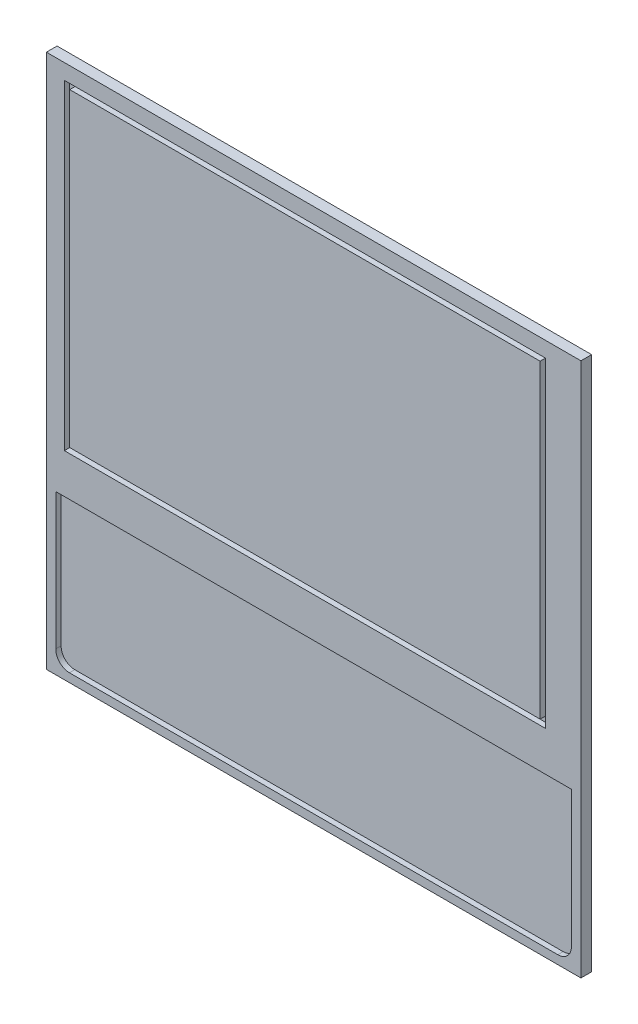
ISO-10303-21;
HEADER;
FILE_DESCRIPTION(('STEP AP214'),'2;1');
FILE_NAME('part.step','',(''),(''),'','','');
FILE_SCHEMA(('AUTOMOTIVE_DESIGN { 1 0 10303 214 1 1 1 1 }'));
ENDSEC;
DATA;
#1=APPLICATION_CONTEXT('core data for automotive mechanical design processes');
#2=APPLICATION_PROTOCOL_DEFINITION('international standard','automotive_design',2000,#1);
#3=PRODUCT_CONTEXT('',#1,'mechanical');
#4=PRODUCT('Part','Part','',(#3));
#5=PRODUCT_RELATED_PRODUCT_CATEGORY('part','',(#4));
#6=PRODUCT_DEFINITION_FORMATION('','',#4);
#7=PRODUCT_DEFINITION_CONTEXT('part definition',#1,'design');
#8=PRODUCT_DEFINITION('design','',#6,#7);
#9=PRODUCT_DEFINITION_SHAPE('','',#8);
#10=(LENGTH_UNIT() NAMED_UNIT(*) SI_UNIT(.MILLI.,.METRE.));
#11=(NAMED_UNIT(*) PLANE_ANGLE_UNIT() SI_UNIT($,.RADIAN.));
#12=(NAMED_UNIT(*) SI_UNIT($,.STERADIAN.) SOLID_ANGLE_UNIT());
#13=UNCERTAINTY_MEASURE_WITH_UNIT(LENGTH_MEASURE(1.E-05),#10,'distance_accuracy_value','');
#14=(GEOMETRIC_REPRESENTATION_CONTEXT(3) GLOBAL_UNCERTAINTY_ASSIGNED_CONTEXT((#13)) GLOBAL_UNIT_ASSIGNED_CONTEXT((#10,
#11,#12)) REPRESENTATION_CONTEXT('',''));
#15=CARTESIAN_POINT('',(0.,0.,0.));
#16=DIRECTION('',(0.,0.,1.));
#17=DIRECTION('',(1.,0.,0.));
#18=AXIS2_PLACEMENT_3D('',#15,#16,#17);
#19=CARTESIAN_POINT('',(250.,250.,10.));
#20=DIRECTION('',(-1.,0.,0.));
#21=DIRECTION('',(0.,-1.,0.));
#22=AXIS2_PLACEMENT_3D('',#19,#20,#21);
#23=PLANE('',#22);
#24=DIRECTION('',(0.,1.,0.));
#25=VECTOR('',#24,1.);
#26=CARTESIAN_POINT('',(250.,250.,0.));
#27=LINE('',#26,#25);
#28=CARTESIAN_POINT('',(250.,-250.,0.));
#29=VERTEX_POINT('',#28);
#30=CARTESIAN_POINT('',(250.,250.,0.));
#31=VERTEX_POINT('',#30);
#32=EDGE_CURVE('E312',#29,#31,#27,.T.);
#33=ORIENTED_EDGE('',*,*,#32,.T.);
#34=DIRECTION('',(0.,0.,-1.));
#35=VECTOR('',#34,1.);
#36=CARTESIAN_POINT('',(250.,250.,10.));
#37=LINE('',#36,#35);
#38=CARTESIAN_POINT('',(250.,250.,10.));
#39=VERTEX_POINT('',#38);
#40=EDGE_CURVE('E11',#39,#31,#37,.T.);
#41=ORIENTED_EDGE('',*,*,#40,.F.);
#42=DIRECTION('',(0.,1.,0.));
#43=VECTOR('',#42,1.);
#44=CARTESIAN_POINT('',(250.,250.,10.));
#45=LINE('',#44,#43);
#46=CARTESIAN_POINT('',(250.,-250.,10.));
#47=VERTEX_POINT('',#46);
#48=EDGE_CURVE('E328',#47,#39,#45,.T.);
#49=ORIENTED_EDGE('',*,*,#48,.F.);
#50=DIRECTION('',(0.,0.,-1.));
#51=VECTOR('',#50,1.);
#52=CARTESIAN_POINT('',(250.,-250.,10.));
#53=LINE('',#52,#51);
#54=EDGE_CURVE('E342',#47,#29,#53,.T.);
#55=ORIENTED_EDGE('',*,*,#54,.T.);
#56=EDGE_LOOP('',(#33,#41,#49,#55));
#57=FACE_BOUND('',#56,.T.);
#58=ADVANCED_FACE('F41',(#57),#23,.F.);
#59=CARTESIAN_POINT('',(-250.,250.,10.));
#60=DIRECTION('',(0.,-1.,0.));
#61=DIRECTION('',(0.,0.,-1.));
#62=AXIS2_PLACEMENT_3D('',#59,#60,#61);
#63=PLANE('',#62);
#64=DIRECTION('',(-1.,0.,0.));
#65=VECTOR('',#64,1.);
#66=CARTESIAN_POINT('',(-250.,250.,0.));
#67=LINE('',#66,#65);
#68=CARTESIAN_POINT('',(-250.,250.,0.));
#69=VERTEX_POINT('',#68);
#70=EDGE_CURVE('E346',#31,#69,#67,.T.);
#71=ORIENTED_EDGE('',*,*,#70,.T.);
#72=DIRECTION('',(0.,0.,-1.));
#73=VECTOR('',#72,1.);
#74=CARTESIAN_POINT('',(-250.,250.,10.));
#75=LINE('',#74,#73);
#76=CARTESIAN_POINT('',(-250.,250.,10.));
#77=VERTEX_POINT('',#76);
#78=EDGE_CURVE('E49',#77,#69,#75,.T.);
#79=ORIENTED_EDGE('',*,*,#78,.F.);
#80=DIRECTION('',(-1.,0.,0.));
#81=VECTOR('',#80,1.);
#82=CARTESIAN_POINT('',(-250.,250.,10.));
#83=LINE('',#82,#81);
#84=EDGE_CURVE('E332',#39,#77,#83,.T.);
#85=ORIENTED_EDGE('',*,*,#84,.F.);
#86=ORIENTED_EDGE('',*,*,#40,.T.);
#87=EDGE_LOOP('',(#71,#79,#85,#86));
#88=FACE_BOUND('',#87,.T.);
#89=ADVANCED_FACE('F382',(#88),#63,.F.);
#90=CARTESIAN_POINT('',(-250.,250.,10.));
#91=DIRECTION('',(1.,0.,0.));
#92=DIRECTION('',(0.,0.,-1.));
#93=AXIS2_PLACEMENT_3D('',#90,#91,#92);
#94=PLANE('',#93);
#95=DIRECTION('',(0.,-1.,0.));
#96=VECTOR('',#95,1.);
#97=CARTESIAN_POINT('',(-250.,250.,0.));
#98=LINE('',#97,#96);
#99=CARTESIAN_POINT('',(-250.,-250.,0.));
#100=VERTEX_POINT('',#99);
#101=EDGE_CURVE('E349',#69,#100,#98,.T.);
#102=ORIENTED_EDGE('',*,*,#101,.T.);
#103=DIRECTION('',(0.,0.,-1.));
#104=VECTOR('',#103,1.);
#105=CARTESIAN_POINT('',(-250.,-250.,10.));
#106=LINE('',#105,#104);
#107=CARTESIAN_POINT('',(-250.,-250.,10.));
#108=VERTEX_POINT('',#107);
#109=EDGE_CURVE('E357',#108,#100,#106,.T.);
#110=ORIENTED_EDGE('',*,*,#109,.F.);
#111=DIRECTION('',(0.,-1.,0.));
#112=VECTOR('',#111,1.);
#113=CARTESIAN_POINT('',(-250.,250.,10.));
#114=LINE('',#113,#112);
#115=EDGE_CURVE('E336',#77,#108,#114,.T.);
#116=ORIENTED_EDGE('',*,*,#115,.F.);
#117=ORIENTED_EDGE('',*,*,#78,.T.);
#118=EDGE_LOOP('',(#102,#110,#116,#117));
#119=FACE_BOUND('',#118,.T.);
#120=ADVANCED_FACE('F366',(#119),#94,.F.);
#121=CARTESIAN_POINT('',(-250.,-250.,10.));
#122=DIRECTION('',(0.,1.,0.));
#123=DIRECTION('',(0.,0.,1.));
#124=AXIS2_PLACEMENT_3D('',#121,#122,#123);
#125=PLANE('',#124);
#126=DIRECTION('',(1.,0.,0.));
#127=VECTOR('',#126,1.);
#128=CARTESIAN_POINT('',(-250.,-250.,0.));
#129=LINE('',#128,#127);
#130=EDGE_CURVE('E333',#100,#29,#129,.T.);
#131=ORIENTED_EDGE('',*,*,#130,.T.);
#132=ORIENTED_EDGE('',*,*,#54,.F.);
#133=DIRECTION('',(1.,0.,0.));
#134=VECTOR('',#133,1.);
#135=CARTESIAN_POINT('',(-250.,-250.,10.));
#136=LINE('',#135,#134);
#137=EDGE_CURVE('E339',#108,#47,#136,.T.);
#138=ORIENTED_EDGE('',*,*,#137,.F.);
#139=ORIENTED_EDGE('',*,*,#109,.T.);
#140=EDGE_LOOP('',(#131,#132,#138,#139));
#141=FACE_BOUND('',#140,.T.);
#142=ADVANCED_FACE('F375',(#141),#125,.F.);
#143=CARTESIAN_POINT('',(0.,0.,10.));
#144=DIRECTION('',(0.,0.,1.));
#145=DIRECTION('',(1.,0.,0.));
#146=AXIS2_PLACEMENT_3D('',#143,#144,#145);
#147=PLANE('',#146);
#148=DIRECTION('',(0.,1.,0.));
#149=VECTOR('',#148,1.);
#150=CARTESIAN_POINT('',(216.840179887879,235.603894721671,10.));
#151=LINE('',#150,#149);
#152=CARTESIAN_POINT('',(216.840179887879,-64.3961052783288,10.));
#153=VERTEX_POINT('',#152);
#154=CARTESIAN_POINT('',(216.840179887879,235.603894721671,10.));
#155=VERTEX_POINT('',#154);
#156=EDGE_CURVE('E56',#153,#155,#151,.T.);
#157=ORIENTED_EDGE('',*,*,#156,.F.);
#158=DIRECTION('',(1.,0.,0.));
#159=VECTOR('',#158,1.);
#160=CARTESIAN_POINT('',(-233.159820112121,-64.3961052783288,10.));
#161=LINE('',#160,#159);
#162=CARTESIAN_POINT('',(-233.159820112121,-64.3961052783288,10.));
#163=VERTEX_POINT('',#162);
#164=EDGE_CURVE('E224',#163,#153,#161,.T.);
#165=ORIENTED_EDGE('',*,*,#164,.F.);
#166=DIRECTION('',(0.,-1.,0.));
#167=VECTOR('',#166,1.);
#168=CARTESIAN_POINT('',(-233.159820112121,235.603894721671,10.));
#169=LINE('',#168,#167);
#170=CARTESIAN_POINT('',(-233.159820112121,235.603894721671,10.));
#171=VERTEX_POINT('',#170);
#172=EDGE_CURVE('E243',#171,#163,#169,.T.);
#173=ORIENTED_EDGE('',*,*,#172,.F.);
#174=DIRECTION('',(-1.,0.,0.));
#175=VECTOR('',#174,1.);
#176=CARTESIAN_POINT('',(-233.159820112121,235.603894721671,10.));
#177=LINE('',#176,#175);
#178=EDGE_CURVE('E239',#155,#171,#177,.T.);
#179=ORIENTED_EDGE('',*,*,#178,.F.);
#180=EDGE_LOOP('',(#157,#165,#173,#179));
#181=FACE_BOUND('',#180,.T.);
#182=DIRECTION('',(0.,-1.,0.));
#183=VECTOR('',#182,1.);
#184=CARTESIAN_POINT('',(-241.170400919458,-101.533774049528,10.));
#185=LINE('',#184,#183);
#186=CARTESIAN_POINT('',(-241.170400919458,-101.533774049528,10.));
#187=VERTEX_POINT('',#186);
#188=CARTESIAN_POINT('',(-241.170400919458,-228.946326042144,10.));
#189=VERTEX_POINT('',#188);
#190=EDGE_CURVE('E253',#187,#189,#185,.T.);
#191=ORIENTED_EDGE('',*,*,#190,.F.);
#192=DIRECTION('',(-1.,0.,0.));
#193=VECTOR('',#192,1.);
#194=CARTESIAN_POINT('',(-241.170400919458,-101.533774049528,10.));
#195=LINE('',#194,#193);
#196=CARTESIAN_POINT('',(241.219730905968,-101.533774049528,10.));
#197=VERTEX_POINT('',#196);
#198=EDGE_CURVE('E267',#197,#187,#195,.T.);
#199=ORIENTED_EDGE('',*,*,#198,.F.);
#200=DIRECTION('',(0.00121046490686193,0.999999267387086,0.));
#201=VECTOR('',#200,1.);
#202=CARTESIAN_POINT('',(241.065145693031,-229.240987046108,10.));
#203=LINE('',#202,#201);
#204=CARTESIAN_POINT('',(241.065145693031,-229.240987046108,10.));
#205=VERTEX_POINT('',#204);
#206=EDGE_CURVE('E302',#205,#197,#203,.T.);
#207=ORIENTED_EDGE('',*,*,#206,.F.);
#208=CARTESIAN_POINT('',(228.352599499758,-229.240987046108,10.));
#209=DIRECTION('',(0.,0.,1.));
#210=DIRECTION('',(1.,0.,0.));
#211=AXIS2_PLACEMENT_3D('',#208,#209,#210);
#212=CIRCLE('',#211,12.7125461932737);
#213=CARTESIAN_POINT('',(228.352599499758,-241.953533239382,10.));
#214=VERTEX_POINT('',#213);
#215=EDGE_CURVE('E298',#214,#205,#212,.T.);
#216=ORIENTED_EDGE('',*,*,#215,.F.);
#217=DIRECTION('',(1.,0.,0.));
#218=VECTOR('',#217,1.);
#219=CARTESIAN_POINT('',(-228.461270122709,-241.953533239382,10.));
#220=LINE('',#219,#218);
#221=CARTESIAN_POINT('',(-228.461270122709,-241.953533239382,10.));
#222=VERTEX_POINT('',#221);
#223=EDGE_CURVE('E294',#222,#214,#220,.T.);
#224=ORIENTED_EDGE('',*,*,#223,.F.);
#225=CARTESIAN_POINT('',(-228.461270122709,-229.240987046108,10.));
#226=DIRECTION('',(0.,0.,1.));
#227=DIRECTION('',(1.,0.,0.));
#228=AXIS2_PLACEMENT_3D('',#225,#226,#227);
#229=CIRCLE('',#228,12.7125461932737);
#230=EDGE_CURVE('E290',#189,#222,#229,.T.);
#231=ORIENTED_EDGE('',*,*,#230,.F.);
#232=EDGE_LOOP('',(#191,#199,#207,#216,#224,#231));
#233=FACE_BOUND('',#232,.T.);
#234=ORIENTED_EDGE('',*,*,#48,.T.);
#235=ORIENTED_EDGE('',*,*,#84,.T.);
#236=ORIENTED_EDGE('',*,*,#115,.T.);
#237=ORIENTED_EDGE('',*,*,#137,.T.);
#238=EDGE_LOOP('',(#234,#235,#236,#237));
#239=FACE_BOUND('',#238,.T.);
#240=ADVANCED_FACE('F381',(#181,#233,#239),#147,.T.);
#241=CARTESIAN_POINT('',(0.,0.,0.));
#242=DIRECTION('',(0.,0.,1.));
#243=DIRECTION('',(1.,0.,0.));
#244=AXIS2_PLACEMENT_3D('',#241,#242,#243);
#245=PLANE('',#244);
#246=ORIENTED_EDGE('',*,*,#32,.F.);
#247=ORIENTED_EDGE('',*,*,#130,.F.);
#248=ORIENTED_EDGE('',*,*,#101,.F.);
#249=ORIENTED_EDGE('',*,*,#70,.F.);
#250=EDGE_LOOP('',(#246,#247,#248,#249));
#251=FACE_BOUND('',#250,.T.);
#252=ADVANCED_FACE('F372',(#251),#245,.F.);
#253=CARTESIAN_POINT('',(-241.170400919458,-101.533774049528,5.));
#254=DIRECTION('',(-1.,0.,0.));
#255=DIRECTION('',(0.,0.,1.));
#256=AXIS2_PLACEMENT_3D('',#253,#254,#255);
#257=PLANE('',#256);
#258=ORIENTED_EDGE('',*,*,#190,.T.);
#259=DIRECTION('',(0.,0.,1.));
#260=VECTOR('',#259,1.);
#261=CARTESIAN_POINT('',(-241.170400919458,-228.946326042144,5.));
#262=LINE('',#261,#260);
#263=CARTESIAN_POINT('',(-241.170400919458,-228.946326042144,5.));
#264=VERTEX_POINT('',#263);
#265=EDGE_CURVE('E287',#264,#189,#262,.T.);
#266=ORIENTED_EDGE('',*,*,#265,.F.);
#267=DIRECTION('',(0.,-1.,0.));
#268=VECTOR('',#267,1.);
#269=CARTESIAN_POINT('',(-241.170400919458,-101.533774049528,5.));
#270=LINE('',#269,#268);
#271=CARTESIAN_POINT('',(-241.170400919458,-101.533774049528,5.));
#272=VERTEX_POINT('',#271);
#273=EDGE_CURVE('E262',#272,#264,#270,.T.);
#274=ORIENTED_EDGE('',*,*,#273,.F.);
#275=DIRECTION('',(0.,0.,1.));
#276=VECTOR('',#275,1.);
#277=CARTESIAN_POINT('',(-241.170400919458,-101.533774049528,5.));
#278=LINE('',#277,#276);
#279=EDGE_CURVE('E309',#272,#187,#278,.T.);
#280=ORIENTED_EDGE('',*,*,#279,.T.);
#281=EDGE_LOOP('',(#258,#266,#274,#280));
#282=FACE_BOUND('',#281,.T.);
#283=ADVANCED_FACE('F394',(#282),#257,.F.);
#284=CARTESIAN_POINT('',(-241.170400919458,-101.533774049528,5.));
#285=DIRECTION('',(0.,1.,0.));
#286=DIRECTION('',(0.,0.,1.));
#287=AXIS2_PLACEMENT_3D('',#284,#285,#286);
#288=PLANE('',#287);
#289=ORIENTED_EDGE('',*,*,#198,.T.);
#290=ORIENTED_EDGE('',*,*,#279,.F.);
#291=DIRECTION('',(-1.,0.,0.));
#292=VECTOR('',#291,1.);
#293=CARTESIAN_POINT('',(-241.170400919458,-101.533774049528,5.));
#294=LINE('',#293,#292);
#295=CARTESIAN_POINT('',(241.219730905968,-101.533774049528,5.));
#296=VERTEX_POINT('',#295);
#297=EDGE_CURVE('E283',#296,#272,#294,.T.);
#298=ORIENTED_EDGE('',*,*,#297,.F.);
#299=DIRECTION('',(0.,0.,1.));
#300=VECTOR('',#299,1.);
#301=CARTESIAN_POINT('',(241.219730905968,-101.533774049528,5.));
#302=LINE('',#301,#300);
#303=EDGE_CURVE('E313',#296,#197,#302,.T.);
#304=ORIENTED_EDGE('',*,*,#303,.T.);
#305=EDGE_LOOP('',(#289,#290,#298,#304));
#306=FACE_BOUND('',#305,.T.);
#307=ADVANCED_FACE('F401',(#306),#288,.F.);
#308=CARTESIAN_POINT('',(241.065145693031,-229.240987046108,5.));
#309=DIRECTION('',(0.999999267387086,-0.00121046490686193,0.));
#310=DIRECTION('',(0.00121046490686193,0.999999267387086,0.));
#311=AXIS2_PLACEMENT_3D('',#308,#309,#310);
#312=PLANE('',#311);
#313=ORIENTED_EDGE('',*,*,#206,.T.);
#314=ORIENTED_EDGE('',*,*,#303,.F.);
#315=DIRECTION('',(0.00121046490686193,0.999999267387086,0.));
#316=VECTOR('',#315,1.);
#317=CARTESIAN_POINT('',(241.065145693031,-229.240987046108,5.));
#318=LINE('',#317,#316);
#319=CARTESIAN_POINT('',(241.065145693031,-229.240987046108,5.));
#320=VERTEX_POINT('',#319);
#321=EDGE_CURVE('E279',#320,#296,#318,.T.);
#322=ORIENTED_EDGE('',*,*,#321,.F.);
#323=DIRECTION('',(0.,0.,1.));
#324=VECTOR('',#323,1.);
#325=CARTESIAN_POINT('',(241.065145693031,-229.240987046108,5.));
#326=LINE('',#325,#324);
#327=EDGE_CURVE('E316',#320,#205,#326,.T.);
#328=ORIENTED_EDGE('',*,*,#327,.T.);
#329=EDGE_LOOP('',(#313,#314,#322,#328));
#330=FACE_BOUND('',#329,.T.);
#331=ADVANCED_FACE('F415',(#330),#312,.F.);
#332=CARTESIAN_POINT('',(228.352599499758,-229.240987046108,5.));
#333=DIRECTION('',(0.,0.,1.));
#334=DIRECTION('',(1.,0.,0.));
#335=AXIS2_PLACEMENT_3D('',#332,#333,#334);
#336=CYLINDRICAL_SURFACE('',#335,12.7125461932737);
#337=ORIENTED_EDGE('',*,*,#215,.T.);
#338=ORIENTED_EDGE('',*,*,#327,.F.);
#339=CARTESIAN_POINT('',(228.352599499758,-229.240987046108,5.));
#340=DIRECTION('',(0.,0.,1.));
#341=DIRECTION('',(1.,0.,0.));
#342=AXIS2_PLACEMENT_3D('',#339,#340,#341);
#343=CIRCLE('',#342,12.7125461932737);
#344=CARTESIAN_POINT('',(228.352599499758,-241.953533239382,5.));
#345=VERTEX_POINT('',#344);
#346=EDGE_CURVE('E275',#345,#320,#343,.T.);
#347=ORIENTED_EDGE('',*,*,#346,.F.);
#348=DIRECTION('',(0.,0.,1.));
#349=VECTOR('',#348,1.);
#350=CARTESIAN_POINT('',(228.352599499758,-241.953533239382,5.));
#351=LINE('',#350,#349);
#352=EDGE_CURVE('E319',#345,#214,#351,.T.);
#353=ORIENTED_EDGE('',*,*,#352,.T.);
#354=EDGE_LOOP('',(#337,#338,#347,#353));
#355=FACE_BOUND('',#354,.T.);
#356=ADVANCED_FACE('F411',(#355),#336,.F.);
#357=CARTESIAN_POINT('',(-228.461270122709,-241.953533239382,5.));
#358=DIRECTION('',(0.,-1.,0.));
#359=DIRECTION('',(0.,0.,-1.));
#360=AXIS2_PLACEMENT_3D('',#357,#358,#359);
#361=PLANE('',#360);
#362=ORIENTED_EDGE('',*,*,#223,.T.);
#363=ORIENTED_EDGE('',*,*,#352,.F.);
#364=DIRECTION('',(1.,0.,0.));
#365=VECTOR('',#364,1.);
#366=CARTESIAN_POINT('',(-228.461270122709,-241.953533239382,5.));
#367=LINE('',#366,#365);
#368=CARTESIAN_POINT('',(-228.461270122709,-241.953533239382,5.));
#369=VERTEX_POINT('',#368);
#370=EDGE_CURVE('E271',#369,#345,#367,.T.);
#371=ORIENTED_EDGE('',*,*,#370,.F.);
#372=DIRECTION('',(0.,0.,1.));
#373=VECTOR('',#372,1.);
#374=CARTESIAN_POINT('',(-228.461270122709,-241.953533239382,5.));
#375=LINE('',#374,#373);
#376=EDGE_CURVE('E322',#369,#222,#375,.T.);
#377=ORIENTED_EDGE('',*,*,#376,.T.);
#378=EDGE_LOOP('',(#362,#363,#371,#377));
#379=FACE_BOUND('',#378,.T.);
#380=ADVANCED_FACE('F407',(#379),#361,.F.);
#381=CARTESIAN_POINT('',(-228.461270122709,-229.240987046108,5.));
#382=DIRECTION('',(0.,0.,1.));
#383=DIRECTION('',(1.,0.,0.));
#384=AXIS2_PLACEMENT_3D('',#381,#382,#383);
#385=CYLINDRICAL_SURFACE('',#384,12.7125461932737);
#386=ORIENTED_EDGE('',*,*,#230,.T.);
#387=ORIENTED_EDGE('',*,*,#376,.F.);
#388=CARTESIAN_POINT('',(-228.461270122709,-229.240987046108,5.));
#389=DIRECTION('',(0.,0.,1.));
#390=DIRECTION('',(1.,0.,0.));
#391=AXIS2_PLACEMENT_3D('',#388,#389,#390);
#392=CIRCLE('',#391,12.7125461932737);
#393=EDGE_CURVE('E266',#264,#369,#392,.T.);
#394=ORIENTED_EDGE('',*,*,#393,.F.);
#395=ORIENTED_EDGE('',*,*,#265,.T.);
#396=EDGE_LOOP('',(#386,#387,#394,#395));
#397=FACE_BOUND('',#396,.T.);
#398=ADVANCED_FACE('F403',(#397),#385,.F.);
#399=CARTESIAN_POINT('',(-228.461270122709,-229.240987046108,5.));
#400=DIRECTION('',(0.,0.,1.));
#401=DIRECTION('',(1.,0.,0.));
#402=AXIS2_PLACEMENT_3D('',#399,#400,#401);
#403=PLANE('',#402);
#404=ORIENTED_EDGE('',*,*,#273,.T.);
#405=ORIENTED_EDGE('',*,*,#393,.T.);
#406=ORIENTED_EDGE('',*,*,#370,.T.);
#407=ORIENTED_EDGE('',*,*,#346,.T.);
#408=ORIENTED_EDGE('',*,*,#321,.T.);
#409=ORIENTED_EDGE('',*,*,#297,.T.);
#410=EDGE_LOOP('',(#404,#405,#406,#407,#408,#409));
#411=FACE_BOUND('',#410,.T.);
#412=ADVANCED_FACE('F406',(#411),#403,.T.);
#413=CARTESIAN_POINT('',(216.840179887879,235.603894721671,5.));
#414=DIRECTION('',(1.,0.,0.));
#415=DIRECTION('',(0.,1.,0.));
#416=AXIS2_PLACEMENT_3D('',#413,#414,#415);
#417=PLANE('',#416);
#418=ORIENTED_EDGE('',*,*,#156,.T.);
#419=DIRECTION('',(0.,0.,1.));
#420=VECTOR('',#419,1.);
#421=CARTESIAN_POINT('',(216.840179887879,235.603894721671,5.));
#422=LINE('',#421,#420);
#423=CARTESIAN_POINT('',(216.840179887879,235.603894721671,5.));
#424=VERTEX_POINT('',#423);
#425=EDGE_CURVE('E236',#424,#155,#422,.T.);
#426=ORIENTED_EDGE('',*,*,#425,.F.);
#427=DIRECTION('',(0.,1.,0.));
#428=VECTOR('',#427,1.);
#429=CARTESIAN_POINT('',(216.840179887879,235.603894721671,5.));
#430=LINE('',#429,#428);
#431=CARTESIAN_POINT('',(216.840179887879,-64.3961052783288,5.));
#432=VERTEX_POINT('',#431);
#433=EDGE_CURVE('E219',#432,#424,#430,.T.);
#434=ORIENTED_EDGE('',*,*,#433,.F.);
#435=DIRECTION('',(0.,0.,1.));
#436=VECTOR('',#435,1.);
#437=CARTESIAN_POINT('',(216.840179887879,-64.3961052783288,5.));
#438=LINE('',#437,#436);
#439=EDGE_CURVE('E250',#432,#153,#438,.T.);
#440=ORIENTED_EDGE('',*,*,#439,.T.);
#441=EDGE_LOOP('',(#418,#426,#434,#440));
#442=FACE_BOUND('',#441,.T.);
#443=ADVANCED_FACE('F425',(#442),#417,.F.);
#444=CARTESIAN_POINT('',(-233.159820112121,-64.3961052783288,5.));
#445=DIRECTION('',(0.,-1.,0.));
#446=DIRECTION('',(0.,0.,-1.));
#447=AXIS2_PLACEMENT_3D('',#444,#445,#446);
#448=PLANE('',#447);
#449=ORIENTED_EDGE('',*,*,#164,.T.);
#450=ORIENTED_EDGE('',*,*,#439,.F.);
#451=DIRECTION('',(1.,0.,0.));
#452=VECTOR('',#451,1.);
#453=CARTESIAN_POINT('',(-233.159820112121,-64.3961052783288,5.));
#454=LINE('',#453,#452);
#455=CARTESIAN_POINT('',(-233.159820112121,-64.3961052783288,5.));
#456=VERTEX_POINT('',#455);
#457=EDGE_CURVE('E232',#456,#432,#454,.T.);
#458=ORIENTED_EDGE('',*,*,#457,.F.);
#459=DIRECTION('',(0.,0.,1.));
#460=VECTOR('',#459,1.);
#461=CARTESIAN_POINT('',(-233.159820112121,-64.3961052783288,5.));
#462=LINE('',#461,#460);
#463=EDGE_CURVE('E254',#456,#163,#462,.T.);
#464=ORIENTED_EDGE('',*,*,#463,.T.);
#465=EDGE_LOOP('',(#449,#450,#458,#464));
#466=FACE_BOUND('',#465,.T.);
#467=ADVANCED_FACE('F429',(#466),#448,.F.);
#468=CARTESIAN_POINT('',(-233.159820112121,235.603894721671,5.));
#469=DIRECTION('',(-1.,0.,0.));
#470=DIRECTION('',(0.,-1.,0.));
#471=AXIS2_PLACEMENT_3D('',#468,#469,#470);
#472=PLANE('',#471);
#473=ORIENTED_EDGE('',*,*,#172,.T.);
#474=ORIENTED_EDGE('',*,*,#463,.F.);
#475=DIRECTION('',(0.,-1.,0.));
#476=VECTOR('',#475,1.);
#477=CARTESIAN_POINT('',(-233.159820112121,235.603894721671,5.));
#478=LINE('',#477,#476);
#479=CARTESIAN_POINT('',(-233.159820112121,235.603894721671,5.));
#480=VERTEX_POINT('',#479);
#481=EDGE_CURVE('E228',#480,#456,#478,.T.);
#482=ORIENTED_EDGE('',*,*,#481,.F.);
#483=DIRECTION('',(0.,0.,1.));
#484=VECTOR('',#483,1.);
#485=CARTESIAN_POINT('',(-233.159820112121,235.603894721671,5.));
#486=LINE('',#485,#484);
#487=EDGE_CURVE('E257',#480,#171,#486,.T.);
#488=ORIENTED_EDGE('',*,*,#487,.T.);
#489=EDGE_LOOP('',(#473,#474,#482,#488));
#490=FACE_BOUND('',#489,.T.);
#491=ADVANCED_FACE('F433',(#490),#472,.F.);
#492=CARTESIAN_POINT('',(-233.159820112121,235.603894721671,5.));
#493=DIRECTION('',(0.,1.,0.));
#494=DIRECTION('',(0.,0.,1.));
#495=AXIS2_PLACEMENT_3D('',#492,#493,#494);
#496=PLANE('',#495);
#497=ORIENTED_EDGE('',*,*,#178,.T.);
#498=ORIENTED_EDGE('',*,*,#487,.F.);
#499=DIRECTION('',(-1.,0.,0.));
#500=VECTOR('',#499,1.);
#501=CARTESIAN_POINT('',(-233.159820112121,235.603894721671,5.));
#502=LINE('',#501,#500);
#503=EDGE_CURVE('E223',#424,#480,#502,.T.);
#504=ORIENTED_EDGE('',*,*,#503,.F.);
#505=ORIENTED_EDGE('',*,*,#425,.T.);
#506=EDGE_LOOP('',(#497,#498,#504,#505));
#507=FACE_BOUND('',#506,.T.);
#508=ADVANCED_FACE('F430',(#507),#496,.F.);
#509=CARTESIAN_POINT('',(0.,0.,5.));
#510=DIRECTION('',(0.,0.,1.));
#511=DIRECTION('',(1.,0.,0.));
#512=AXIS2_PLACEMENT_3D('',#509,#510,#511);
#513=PLANE('',#512);
#514=DIRECTION('',(1.,0.,0.));
#515=VECTOR('',#514,1.);
#516=CARTESIAN_POINT('',(-228.159820112121,-59.3961052783288,5.));
#517=LINE('',#516,#515);
#518=CARTESIAN_POINT('',(-228.159820112121,-59.3961052783288,5.));
#519=VERTEX_POINT('',#518);
#520=CARTESIAN_POINT('',(211.840179887879,-59.3961052783288,5.));
#521=VERTEX_POINT('',#520);
#522=EDGE_CURVE('E179',#519,#521,#517,.T.);
#523=ORIENTED_EDGE('',*,*,#522,.F.);
#524=DIRECTION('',(0.,-1.,0.));
#525=VECTOR('',#524,1.);
#526=CARTESIAN_POINT('',(-228.159820112121,230.603894721671,5.));
#527=LINE('',#526,#525);
#528=CARTESIAN_POINT('',(-228.159820112121,230.603894721671,5.));
#529=VERTEX_POINT('',#528);
#530=EDGE_CURVE('E189',#529,#519,#527,.T.);
#531=ORIENTED_EDGE('',*,*,#530,.F.);
#532=DIRECTION('',(-1.,0.,0.));
#533=VECTOR('',#532,1.);
#534=CARTESIAN_POINT('',(-228.159820112121,230.603894721671,5.));
#535=LINE('',#534,#533);
#536=CARTESIAN_POINT('',(211.840179887879,230.603894721671,5.));
#537=VERTEX_POINT('',#536);
#538=EDGE_CURVE('E170',#537,#529,#535,.T.);
#539=ORIENTED_EDGE('',*,*,#538,.F.);
#540=DIRECTION('',(0.,1.,0.));
#541=VECTOR('',#540,1.);
#542=CARTESIAN_POINT('',(211.840179887879,230.603894721671,5.));
#543=LINE('',#542,#541);
#544=EDGE_CURVE('E186',#521,#537,#543,.T.);
#545=ORIENTED_EDGE('',*,*,#544,.F.);
#546=EDGE_LOOP('',(#523,#531,#539,#545));
#547=FACE_BOUND('',#546,.T.);
#548=ORIENTED_EDGE('',*,*,#433,.T.);
#549=ORIENTED_EDGE('',*,*,#503,.T.);
#550=ORIENTED_EDGE('',*,*,#481,.T.);
#551=ORIENTED_EDGE('',*,*,#457,.T.);
#552=EDGE_LOOP('',(#548,#549,#550,#551));
#553=FACE_BOUND('',#552,.T.);
#554=ADVANCED_FACE('F184',(#547,#553),#513,.T.);
#555=CARTESIAN_POINT('',(211.840179887879,230.603894721671,5.));
#556=DIRECTION('',(1.,0.,0.));
#557=DIRECTION('',(0.,1.,0.));
#558=AXIS2_PLACEMENT_3D('',#555,#556,#557);
#559=PLANE('',#558);
#560=DIRECTION('',(0.,1.,0.));
#561=VECTOR('',#560,1.);
#562=CARTESIAN_POINT('',(211.840179887879,230.603894721671,10.));
#563=LINE('',#562,#561);
#564=CARTESIAN_POINT('',(211.840179887879,-59.3961052783288,10.));
#565=VERTEX_POINT('',#564);
#566=CARTESIAN_POINT('',(211.840179887879,230.603894721671,10.));
#567=VERTEX_POINT('',#566);
#568=EDGE_CURVE('E205',#565,#567,#563,.T.);
#569=ORIENTED_EDGE('',*,*,#568,.F.);
#570=DIRECTION('',(0.,0.,1.));
#571=VECTOR('',#570,1.);
#572=CARTESIAN_POINT('',(211.840179887879,-59.3961052783288,5.));
#573=LINE('',#572,#571);
#574=EDGE_CURVE('E193',#521,#565,#573,.T.);
#575=ORIENTED_EDGE('',*,*,#574,.F.);
#576=ORIENTED_EDGE('',*,*,#544,.T.);
#577=DIRECTION('',(0.,0.,1.));
#578=VECTOR('',#577,1.);
#579=CARTESIAN_POINT('',(211.840179887879,230.603894721671,5.));
#580=LINE('',#579,#578);
#581=EDGE_CURVE('E167',#537,#567,#580,.T.);
#582=ORIENTED_EDGE('',*,*,#581,.T.);
#583=EDGE_LOOP('',(#569,#575,#576,#582));
#584=FACE_BOUND('',#583,.T.);
#585=ADVANCED_FACE('F192',(#584),#559,.T.);
#586=CARTESIAN_POINT('',(-228.159820112121,-59.3961052783288,5.));
#587=DIRECTION('',(0.,-1.,0.));
#588=DIRECTION('',(0.,0.,-1.));
#589=AXIS2_PLACEMENT_3D('',#586,#587,#588);
#590=PLANE('',#589);
#591=DIRECTION('',(1.,0.,0.));
#592=VECTOR('',#591,1.);
#593=CARTESIAN_POINT('',(-228.159820112121,-59.3961052783288,10.));
#594=LINE('',#593,#592);
#595=CARTESIAN_POINT('',(-228.159820112121,-59.3961052783288,10.));
#596=VERTEX_POINT('',#595);
#597=EDGE_CURVE('E195',#596,#565,#594,.T.);
#598=ORIENTED_EDGE('',*,*,#597,.F.);
#599=DIRECTION('',(0.,0.,1.));
#600=VECTOR('',#599,1.);
#601=CARTESIAN_POINT('',(-228.159820112121,-59.3961052783288,5.));
#602=LINE('',#601,#600);
#603=EDGE_CURVE('E214',#519,#596,#602,.T.);
#604=ORIENTED_EDGE('',*,*,#603,.F.);
#605=ORIENTED_EDGE('',*,*,#522,.T.);
#606=ORIENTED_EDGE('',*,*,#574,.T.);
#607=EDGE_LOOP('',(#598,#604,#605,#606));
#608=FACE_BOUND('',#607,.T.);
#609=ADVANCED_FACE('F445',(#608),#590,.T.);
#610=CARTESIAN_POINT('',(-228.159820112121,230.603894721671,5.));
#611=DIRECTION('',(-1.,0.,0.));
#612=DIRECTION('',(0.,-1.,0.));
#613=AXIS2_PLACEMENT_3D('',#610,#611,#612);
#614=PLANE('',#613);
#615=DIRECTION('',(0.,-1.,0.));
#616=VECTOR('',#615,1.);
#617=CARTESIAN_POINT('',(-228.159820112121,230.603894721671,10.));
#618=LINE('',#617,#616);
#619=CARTESIAN_POINT('',(-228.159820112121,230.603894721671,10.));
#620=VERTEX_POINT('',#619);
#621=EDGE_CURVE('E64',#620,#596,#618,.T.);
#622=ORIENTED_EDGE('',*,*,#621,.F.);
#623=DIRECTION('',(0.,0.,1.));
#624=VECTOR('',#623,1.);
#625=CARTESIAN_POINT('',(-228.159820112121,230.603894721671,5.));
#626=LINE('',#625,#624);
#627=EDGE_CURVE('E178',#529,#620,#626,.T.);
#628=ORIENTED_EDGE('',*,*,#627,.F.);
#629=ORIENTED_EDGE('',*,*,#530,.T.);
#630=ORIENTED_EDGE('',*,*,#603,.T.);
#631=EDGE_LOOP('',(#622,#628,#629,#630));
#632=FACE_BOUND('',#631,.T.);
#633=ADVANCED_FACE('F448',(#632),#614,.T.);
#634=CARTESIAN_POINT('',(-228.159820112121,230.603894721671,5.));
#635=DIRECTION('',(0.,1.,0.));
#636=DIRECTION('',(0.,0.,1.));
#637=AXIS2_PLACEMENT_3D('',#634,#635,#636);
#638=PLANE('',#637);
#639=DIRECTION('',(-1.,0.,0.));
#640=VECTOR('',#639,1.);
#641=CARTESIAN_POINT('',(-228.159820112121,230.603894721671,10.));
#642=LINE('',#641,#640);
#643=EDGE_CURVE('E172',#567,#620,#642,.T.);
#644=ORIENTED_EDGE('',*,*,#643,.F.);
#645=ORIENTED_EDGE('',*,*,#581,.F.);
#646=ORIENTED_EDGE('',*,*,#538,.T.);
#647=ORIENTED_EDGE('',*,*,#627,.T.);
#648=EDGE_LOOP('',(#644,#645,#646,#647));
#649=FACE_BOUND('',#648,.T.);
#650=ADVANCED_FACE('F169',(#649),#638,.T.);
#651=ORIENTED_EDGE('',*,*,#597,.T.);
#652=ORIENTED_EDGE('',*,*,#568,.T.);
#653=ORIENTED_EDGE('',*,*,#643,.T.);
#654=ORIENTED_EDGE('',*,*,#621,.T.);
#655=EDGE_LOOP('',(#651,#652,#653,#654));
#656=FACE_BOUND('',#655,.T.);
#657=ADVANCED_FACE('F398',(#656),#147,.T.);
#658=CLOSED_SHELL('',(#58,#89,#120,#142,#240,#252,#283,#307,#331,#356,#380,#398,#412,#443,#467,
#491,#508,#554,#585,#609,#633,#650,#657));
#659=MANIFOLD_SOLID_BREP('B2',#658);
#660=ADVANCED_BREP_SHAPE_REPRESENTATION('',(#18,#659),#14);
#661=SHAPE_DEFINITION_REPRESENTATION(#9,#660);
ENDSEC;
END-ISO-10303-21;
